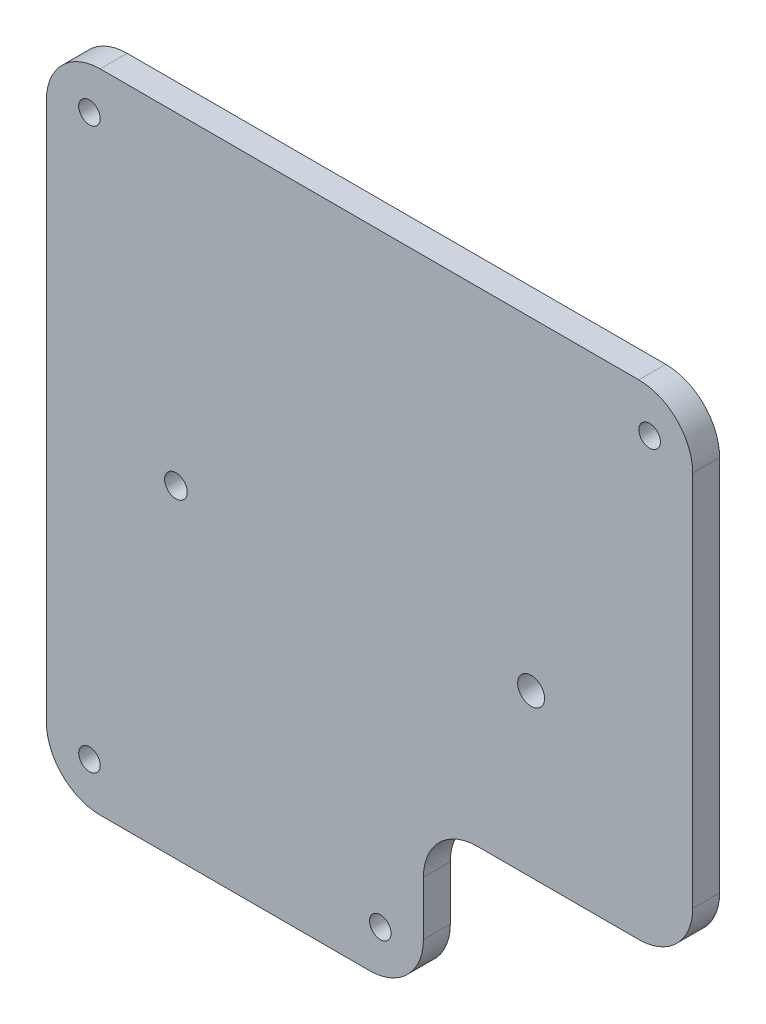
ISO-10303-21;
HEADER;
FILE_DESCRIPTION(('STEP AP214'),'2;1');
FILE_NAME('part.step','',(''),(''),'','','');
FILE_SCHEMA(('AUTOMOTIVE_DESIGN { 1 0 10303 214 1 1 1 1 }'));
ENDSEC;
DATA;
#1=APPLICATION_CONTEXT('core data for automotive mechanical design processes');
#2=APPLICATION_PROTOCOL_DEFINITION('international standard','automotive_design',2000,#1);
#3=PRODUCT_CONTEXT('',#1,'mechanical');
#4=PRODUCT('Part','Part','',(#3));
#5=PRODUCT_RELATED_PRODUCT_CATEGORY('part','',(#4));
#6=PRODUCT_DEFINITION_FORMATION('','',#4);
#7=PRODUCT_DEFINITION_CONTEXT('part definition',#1,'design');
#8=PRODUCT_DEFINITION('design','',#6,#7);
#9=PRODUCT_DEFINITION_SHAPE('','',#8);
#10=(LENGTH_UNIT() NAMED_UNIT(*) SI_UNIT(.MILLI.,.METRE.));
#11=(NAMED_UNIT(*) PLANE_ANGLE_UNIT() SI_UNIT($,.RADIAN.));
#12=(NAMED_UNIT(*) SI_UNIT($,.STERADIAN.) SOLID_ANGLE_UNIT());
#13=UNCERTAINTY_MEASURE_WITH_UNIT(LENGTH_MEASURE(1.E-05),#10,'distance_accuracy_value','');
#14=(GEOMETRIC_REPRESENTATION_CONTEXT(3) GLOBAL_UNCERTAINTY_ASSIGNED_CONTEXT((#13)) GLOBAL_UNIT_ASSIGNED_CONTEXT((#10,
#11,#12)) REPRESENTATION_CONTEXT('',''));
#15=CARTESIAN_POINT('',(0.,0.,0.));
#16=DIRECTION('',(0.,0.,1.));
#17=DIRECTION('',(1.,0.,0.));
#18=AXIS2_PLACEMENT_3D('',#15,#16,#17);
#19=CARTESIAN_POINT('',(60.,10.,5.));
#20=DIRECTION('',(0.,0.,-1.));
#21=DIRECTION('',(-1.,0.,0.));
#22=AXIS2_PLACEMENT_3D('',#19,#20,#21);
#23=CYLINDRICAL_SURFACE('',#22,10.);
#24=CARTESIAN_POINT('',(60.,10.,0.));
#25=DIRECTION('',(0.,0.,1.));
#26=DIRECTION('',(-1.,0.,0.));
#27=AXIS2_PLACEMENT_3D('',#24,#25,#26);
#28=CIRCLE('',#27,10.);
#29=CARTESIAN_POINT('',(59.9999999999999,0.,0.));
#30=VERTEX_POINT('',#29);
#31=CARTESIAN_POINT('',(70.,10.0000000000001,0.));
#32=VERTEX_POINT('',#31);
#33=EDGE_CURVE('E157',#30,#32,#28,.T.);
#34=ORIENTED_EDGE('',*,*,#33,.T.);
#35=DIRECTION('',(0.,0.,-1.));
#36=VECTOR('',#35,1.);
#37=CARTESIAN_POINT('',(70.,10.0000000000001,5.));
#38=LINE('',#37,#36);
#39=CARTESIAN_POINT('',(70.,10.0000000000001,5.));
#40=VERTEX_POINT('',#39);
#41=EDGE_CURVE('E11',#40,#32,#38,.T.);
#42=ORIENTED_EDGE('',*,*,#41,.F.);
#43=CARTESIAN_POINT('',(60.,10.,5.));
#44=DIRECTION('',(0.,0.,1.));
#45=DIRECTION('',(-1.,0.,0.));
#46=AXIS2_PLACEMENT_3D('',#43,#44,#45);
#47=CIRCLE('',#46,10.);
#48=CARTESIAN_POINT('',(59.9999999999999,0.,5.));
#49=VERTEX_POINT('',#48);
#50=EDGE_CURVE('E180',#49,#40,#47,.T.);
#51=ORIENTED_EDGE('',*,*,#50,.F.);
#52=DIRECTION('',(0.,0.,-1.));
#53=VECTOR('',#52,1.);
#54=CARTESIAN_POINT('',(59.9999999999999,0.,5.));
#55=LINE('',#54,#53);
#56=EDGE_CURVE('E153',#49,#30,#55,.T.);
#57=ORIENTED_EDGE('',*,*,#56,.T.);
#58=EDGE_LOOP('',(#34,#42,#51,#57));
#59=FACE_BOUND('',#58,.T.);
#60=ADVANCED_FACE('F35',(#59),#23,.T.);
#61=CARTESIAN_POINT('',(70.,19.9999999999999,5.));
#62=DIRECTION('',(-1.,0.,0.));
#63=DIRECTION('',(0.,0.,1.));
#64=AXIS2_PLACEMENT_3D('',#61,#62,#63);
#65=PLANE('',#64);
#66=DIRECTION('',(0.,1.,0.));
#67=VECTOR('',#66,1.);
#68=CARTESIAN_POINT('',(70.,19.9999999999999,0.));
#69=LINE('',#68,#67);
#70=CARTESIAN_POINT('',(70.,19.9999999999999,0.));
#71=VERTEX_POINT('',#70);
#72=EDGE_CURVE('E160',#32,#71,#69,.T.);
#73=ORIENTED_EDGE('',*,*,#72,.T.);
#74=DIRECTION('',(0.,0.,-1.));
#75=VECTOR('',#74,1.);
#76=CARTESIAN_POINT('',(70.,19.9999999999999,5.));
#77=LINE('',#76,#75);
#78=CARTESIAN_POINT('',(70.,19.9999999999999,5.));
#79=VERTEX_POINT('',#78);
#80=EDGE_CURVE('E44',#79,#71,#77,.T.);
#81=ORIENTED_EDGE('',*,*,#80,.F.);
#82=DIRECTION('',(0.,1.,0.));
#83=VECTOR('',#82,1.);
#84=CARTESIAN_POINT('',(70.,19.9999999999999,5.));
#85=LINE('',#84,#83);
#86=EDGE_CURVE('E108',#40,#79,#85,.T.);
#87=ORIENTED_EDGE('',*,*,#86,.F.);
#88=ORIENTED_EDGE('',*,*,#41,.T.);
#89=EDGE_LOOP('',(#73,#81,#87,#88));
#90=FACE_BOUND('',#89,.T.);
#91=ADVANCED_FACE('F273',(#90),#65,.F.);
#92=CARTESIAN_POINT('',(80.,20.,5.));
#93=DIRECTION('',(0.,0.,-1.));
#94=DIRECTION('',(-1.,0.,0.));
#95=AXIS2_PLACEMENT_3D('',#92,#93,#94);
#96=CYLINDRICAL_SURFACE('',#95,10.);
#97=CARTESIAN_POINT('',(80.,20.,0.));
#98=DIRECTION('',(0.,0.,-1.));
#99=DIRECTION('',(1.,0.,0.));
#100=AXIS2_PLACEMENT_3D('',#97,#98,#99);
#101=CIRCLE('',#100,10.);
#102=CARTESIAN_POINT('',(80.0000000000001,30.,0.));
#103=VERTEX_POINT('',#102);
#104=EDGE_CURVE('E163',#71,#103,#101,.T.);
#105=ORIENTED_EDGE('',*,*,#104,.T.);
#106=DIRECTION('',(0.,0.,-1.));
#107=VECTOR('',#106,1.);
#108=CARTESIAN_POINT('',(80.0000000000001,30.,5.));
#109=LINE('',#108,#107);
#110=CARTESIAN_POINT('',(80.0000000000001,30.,5.));
#111=VERTEX_POINT('',#110);
#112=EDGE_CURVE('E199',#111,#103,#109,.T.);
#113=ORIENTED_EDGE('',*,*,#112,.F.);
#114=CARTESIAN_POINT('',(80.,20.,5.));
#115=DIRECTION('',(0.,0.,-1.));
#116=DIRECTION('',(1.,0.,0.));
#117=AXIS2_PLACEMENT_3D('',#114,#115,#116);
#118=CIRCLE('',#117,10.);
#119=EDGE_CURVE('E233',#79,#111,#118,.T.);
#120=ORIENTED_EDGE('',*,*,#119,.F.);
#121=ORIENTED_EDGE('',*,*,#80,.T.);
#122=EDGE_LOOP('',(#105,#113,#120,#121));
#123=FACE_BOUND('',#122,.T.);
#124=ADVANCED_FACE('F277',(#123),#96,.F.);
#125=CARTESIAN_POINT('',(110.,30.,5.));
#126=DIRECTION('',(0.,1.,0.));
#127=DIRECTION('',(-1.,0.,0.));
#128=AXIS2_PLACEMENT_3D('',#125,#126,#127);
#129=PLANE('',#128);
#130=DIRECTION('',(1.,0.,0.));
#131=VECTOR('',#130,1.);
#132=CARTESIAN_POINT('',(110.,30.,0.));
#133=LINE('',#132,#131);
#134=CARTESIAN_POINT('',(110.,30.,0.));
#135=VERTEX_POINT('',#134);
#136=EDGE_CURVE('E165',#103,#135,#133,.T.);
#137=ORIENTED_EDGE('',*,*,#136,.T.);
#138=DIRECTION('',(0.,0.,-1.));
#139=VECTOR('',#138,1.);
#140=CARTESIAN_POINT('',(110.,30.,5.));
#141=LINE('',#140,#139);
#142=CARTESIAN_POINT('',(110.,30.,5.));
#143=VERTEX_POINT('',#142);
#144=EDGE_CURVE('E196',#143,#135,#141,.T.);
#145=ORIENTED_EDGE('',*,*,#144,.F.);
#146=DIRECTION('',(1.,0.,0.));
#147=VECTOR('',#146,1.);
#148=CARTESIAN_POINT('',(110.,30.,5.));
#149=LINE('',#148,#147);
#150=EDGE_CURVE('E235',#111,#143,#149,.T.);
#151=ORIENTED_EDGE('',*,*,#150,.F.);
#152=ORIENTED_EDGE('',*,*,#112,.T.);
#153=EDGE_LOOP('',(#137,#145,#151,#152));
#154=FACE_BOUND('',#153,.T.);
#155=ADVANCED_FACE('F281',(#154),#129,.F.);
#156=CARTESIAN_POINT('',(110.,40.,5.));
#157=DIRECTION('',(0.,0.,-1.));
#158=DIRECTION('',(-1.,0.,0.));
#159=AXIS2_PLACEMENT_3D('',#156,#157,#158);
#160=CYLINDRICAL_SURFACE('',#159,10.);
#161=CARTESIAN_POINT('',(110.,40.,0.));
#162=DIRECTION('',(0.,0.,1.));
#163=DIRECTION('',(1.,0.,0.));
#164=AXIS2_PLACEMENT_3D('',#161,#162,#163);
#165=CIRCLE('',#164,10.);
#166=CARTESIAN_POINT('',(120.,40.,0.));
#167=VERTEX_POINT('',#166);
#168=EDGE_CURVE('E167',#135,#167,#165,.T.);
#169=ORIENTED_EDGE('',*,*,#168,.T.);
#170=DIRECTION('',(0.,0.,-1.));
#171=VECTOR('',#170,1.);
#172=CARTESIAN_POINT('',(120.,40.,5.));
#173=LINE('',#172,#171);
#174=CARTESIAN_POINT('',(120.,40.,5.));
#175=VERTEX_POINT('',#174);
#176=EDGE_CURVE('E193',#175,#167,#173,.T.);
#177=ORIENTED_EDGE('',*,*,#176,.F.);
#178=CARTESIAN_POINT('',(110.,40.,5.));
#179=DIRECTION('',(0.,0.,1.));
#180=DIRECTION('',(1.,0.,0.));
#181=AXIS2_PLACEMENT_3D('',#178,#179,#180);
#182=CIRCLE('',#181,10.);
#183=EDGE_CURVE('E237',#143,#175,#182,.T.);
#184=ORIENTED_EDGE('',*,*,#183,.F.);
#185=ORIENTED_EDGE('',*,*,#144,.T.);
#186=EDGE_LOOP('',(#169,#177,#184,#185));
#187=FACE_BOUND('',#186,.T.);
#188=ADVANCED_FACE('F287',(#187),#160,.T.);
#189=CARTESIAN_POINT('',(120.,40.0000000000001,5.));
#190=DIRECTION('',(-1.,0.,0.));
#191=DIRECTION('',(0.,0.,1.));
#192=AXIS2_PLACEMENT_3D('',#189,#190,#191);
#193=PLANE('',#192);
#194=DIRECTION('',(0.,1.,0.));
#195=VECTOR('',#194,1.);
#196=CARTESIAN_POINT('',(120.,40.0000000000001,0.));
#197=LINE('',#196,#195);
#198=CARTESIAN_POINT('',(120.,110.,0.));
#199=VERTEX_POINT('',#198);
#200=EDGE_CURVE('E169',#167,#199,#197,.T.);
#201=ORIENTED_EDGE('',*,*,#200,.T.);
#202=DIRECTION('',(0.,0.,-1.));
#203=VECTOR('',#202,1.);
#204=CARTESIAN_POINT('',(120.,110.,5.));
#205=LINE('',#204,#203);
#206=CARTESIAN_POINT('',(120.,110.,5.));
#207=VERTEX_POINT('',#206);
#208=EDGE_CURVE('E190',#207,#199,#205,.T.);
#209=ORIENTED_EDGE('',*,*,#208,.F.);
#210=DIRECTION('',(0.,1.,0.));
#211=VECTOR('',#210,1.);
#212=CARTESIAN_POINT('',(120.,40.0000000000001,5.));
#213=LINE('',#212,#211);
#214=EDGE_CURVE('E239',#175,#207,#213,.T.);
#215=ORIENTED_EDGE('',*,*,#214,.F.);
#216=ORIENTED_EDGE('',*,*,#176,.T.);
#217=EDGE_LOOP('',(#201,#209,#215,#216));
#218=FACE_BOUND('',#217,.T.);
#219=ADVANCED_FACE('F291',(#218),#193,.F.);
#220=CARTESIAN_POINT('',(110.,110.,5.));
#221=DIRECTION('',(0.,0.,-1.));
#222=DIRECTION('',(-1.,0.,0.));
#223=AXIS2_PLACEMENT_3D('',#220,#221,#222);
#224=CYLINDRICAL_SURFACE('',#223,9.99999999999999);
#225=CARTESIAN_POINT('',(110.,110.,0.));
#226=DIRECTION('',(0.,0.,1.));
#227=DIRECTION('',(-1.,0.,0.));
#228=AXIS2_PLACEMENT_3D('',#225,#226,#227);
#229=CIRCLE('',#228,9.99999999999999);
#230=CARTESIAN_POINT('',(110.,120.,0.));
#231=VERTEX_POINT('',#230);
#232=EDGE_CURVE('E171',#199,#231,#229,.T.);
#233=ORIENTED_EDGE('',*,*,#232,.T.);
#234=DIRECTION('',(0.,0.,-1.));
#235=VECTOR('',#234,1.);
#236=CARTESIAN_POINT('',(110.,120.,5.));
#237=LINE('',#236,#235);
#238=CARTESIAN_POINT('',(110.,120.,5.));
#239=VERTEX_POINT('',#238);
#240=EDGE_CURVE('E187',#239,#231,#237,.T.);
#241=ORIENTED_EDGE('',*,*,#240,.F.);
#242=CARTESIAN_POINT('',(110.,110.,5.));
#243=DIRECTION('',(0.,0.,1.));
#244=DIRECTION('',(-1.,0.,0.));
#245=AXIS2_PLACEMENT_3D('',#242,#243,#244);
#246=CIRCLE('',#245,9.99999999999999);
#247=EDGE_CURVE('E241',#207,#239,#246,.T.);
#248=ORIENTED_EDGE('',*,*,#247,.F.);
#249=ORIENTED_EDGE('',*,*,#208,.T.);
#250=EDGE_LOOP('',(#233,#241,#248,#249));
#251=FACE_BOUND('',#250,.T.);
#252=ADVANCED_FACE('F295',(#251),#224,.T.);
#253=CARTESIAN_POINT('',(10.0000000000001,120.,5.));
#254=DIRECTION('',(0.,-1.,0.));
#255=DIRECTION('',(0.,0.,-1.));
#256=AXIS2_PLACEMENT_3D('',#253,#254,#255);
#257=PLANE('',#256);
#258=DIRECTION('',(-1.,0.,0.));
#259=VECTOR('',#258,1.);
#260=CARTESIAN_POINT('',(10.0000000000001,120.,0.));
#261=LINE('',#260,#259);
#262=CARTESIAN_POINT('',(10.0000000000001,120.,0.));
#263=VERTEX_POINT('',#262);
#264=EDGE_CURVE('E173',#231,#263,#261,.T.);
#265=ORIENTED_EDGE('',*,*,#264,.T.);
#266=DIRECTION('',(0.,0.,-1.));
#267=VECTOR('',#266,1.);
#268=CARTESIAN_POINT('',(10.0000000000001,120.,5.));
#269=LINE('',#268,#267);
#270=CARTESIAN_POINT('',(10.0000000000001,120.,5.));
#271=VERTEX_POINT('',#270);
#272=EDGE_CURVE('E184',#271,#263,#269,.T.);
#273=ORIENTED_EDGE('',*,*,#272,.F.);
#274=DIRECTION('',(-1.,0.,0.));
#275=VECTOR('',#274,1.);
#276=CARTESIAN_POINT('',(10.0000000000001,120.,5.));
#277=LINE('',#276,#275);
#278=EDGE_CURVE('E243',#239,#271,#277,.T.);
#279=ORIENTED_EDGE('',*,*,#278,.F.);
#280=ORIENTED_EDGE('',*,*,#240,.T.);
#281=EDGE_LOOP('',(#265,#273,#279,#280));
#282=FACE_BOUND('',#281,.T.);
#283=ADVANCED_FACE('F249',(#282),#257,.F.);
#284=CARTESIAN_POINT('',(10.,110.,5.));
#285=DIRECTION('',(0.,0.,-1.));
#286=DIRECTION('',(-1.,0.,0.));
#287=AXIS2_PLACEMENT_3D('',#284,#285,#286);
#288=CYLINDRICAL_SURFACE('',#287,10.);
#289=CARTESIAN_POINT('',(10.,110.,0.));
#290=DIRECTION('',(0.,0.,1.));
#291=DIRECTION('',(-1.,0.,0.));
#292=AXIS2_PLACEMENT_3D('',#289,#290,#291);
#293=CIRCLE('',#292,10.);
#294=CARTESIAN_POINT('',(0.,110.,0.));
#295=VERTEX_POINT('',#294);
#296=EDGE_CURVE('E175',#263,#295,#293,.T.);
#297=ORIENTED_EDGE('',*,*,#296,.T.);
#298=DIRECTION('',(0.,0.,-1.));
#299=VECTOR('',#298,1.);
#300=CARTESIAN_POINT('',(0.,110.,5.));
#301=LINE('',#300,#299);
#302=CARTESIAN_POINT('',(0.,110.,5.));
#303=VERTEX_POINT('',#302);
#304=EDGE_CURVE('E148',#303,#295,#301,.T.);
#305=ORIENTED_EDGE('',*,*,#304,.F.);
#306=CARTESIAN_POINT('',(10.,110.,5.));
#307=DIRECTION('',(0.,0.,1.));
#308=DIRECTION('',(-1.,0.,0.));
#309=AXIS2_PLACEMENT_3D('',#306,#307,#308);
#310=CIRCLE('',#309,10.);
#311=EDGE_CURVE('E139',#271,#303,#310,.T.);
#312=ORIENTED_EDGE('',*,*,#311,.F.);
#313=ORIENTED_EDGE('',*,*,#272,.T.);
#314=EDGE_LOOP('',(#297,#305,#312,#313));
#315=FACE_BOUND('',#314,.T.);
#316=ADVANCED_FACE('F253',(#315),#288,.T.);
#317=CARTESIAN_POINT('',(0.,10.0000000000001,5.));
#318=DIRECTION('',(1.,0.,0.));
#319=DIRECTION('',(0.,0.,-1.));
#320=AXIS2_PLACEMENT_3D('',#317,#318,#319);
#321=PLANE('',#320);
#322=DIRECTION('',(0.,-1.,0.));
#323=VECTOR('',#322,1.);
#324=CARTESIAN_POINT('',(0.,10.0000000000001,0.));
#325=LINE('',#324,#323);
#326=CARTESIAN_POINT('',(0.,10.0000000000001,0.));
#327=VERTEX_POINT('',#326);
#328=EDGE_CURVE('E147',#295,#327,#325,.T.);
#329=ORIENTED_EDGE('',*,*,#328,.T.);
#330=DIRECTION('',(0.,0.,-1.));
#331=VECTOR('',#330,1.);
#332=CARTESIAN_POINT('',(0.,10.0000000000001,5.));
#333=LINE('',#332,#331);
#334=CARTESIAN_POINT('',(0.,10.0000000000001,5.));
#335=VERTEX_POINT('',#334);
#336=EDGE_CURVE('E144',#335,#327,#333,.T.);
#337=ORIENTED_EDGE('',*,*,#336,.F.);
#338=DIRECTION('',(0.,-1.,0.));
#339=VECTOR('',#338,1.);
#340=CARTESIAN_POINT('',(0.,10.0000000000001,5.));
#341=LINE('',#340,#339);
#342=EDGE_CURVE('E133',#303,#335,#341,.T.);
#343=ORIENTED_EDGE('',*,*,#342,.F.);
#344=ORIENTED_EDGE('',*,*,#304,.T.);
#345=EDGE_LOOP('',(#329,#337,#343,#344));
#346=FACE_BOUND('',#345,.T.);
#347=ADVANCED_FACE('F145',(#346),#321,.F.);
#348=CARTESIAN_POINT('',(10.,10.,5.));
#349=DIRECTION('',(0.,0.,-1.));
#350=DIRECTION('',(-1.,0.,0.));
#351=AXIS2_PLACEMENT_3D('',#348,#349,#350);
#352=CYLINDRICAL_SURFACE('',#351,10.);
#353=CARTESIAN_POINT('',(10.,10.,0.));
#354=DIRECTION('',(0.,0.,1.));
#355=DIRECTION('',(-1.,0.,0.));
#356=AXIS2_PLACEMENT_3D('',#353,#354,#355);
#357=CIRCLE('',#356,10.);
#358=CARTESIAN_POINT('',(10.0000000000001,0.,0.));
#359=VERTEX_POINT('',#358);
#360=EDGE_CURVE('E94',#327,#359,#357,.T.);
#361=ORIENTED_EDGE('',*,*,#360,.T.);
#362=DIRECTION('',(0.,0.,-1.));
#363=VECTOR('',#362,1.);
#364=CARTESIAN_POINT('',(10.0000000000001,0.,5.));
#365=LINE('',#364,#363);
#366=CARTESIAN_POINT('',(10.0000000000001,0.,5.));
#367=VERTEX_POINT('',#366);
#368=EDGE_CURVE('E149',#367,#359,#365,.T.);
#369=ORIENTED_EDGE('',*,*,#368,.F.);
#370=CARTESIAN_POINT('',(10.,10.,5.));
#371=DIRECTION('',(0.,0.,1.));
#372=DIRECTION('',(-1.,0.,0.));
#373=AXIS2_PLACEMENT_3D('',#370,#371,#372);
#374=CIRCLE('',#373,10.);
#375=EDGE_CURVE('E137',#335,#367,#374,.T.);
#376=ORIENTED_EDGE('',*,*,#375,.F.);
#377=ORIENTED_EDGE('',*,*,#336,.T.);
#378=EDGE_LOOP('',(#361,#369,#376,#377));
#379=FACE_BOUND('',#378,.T.);
#380=ADVANCED_FACE('F151',(#379),#352,.T.);
#381=CARTESIAN_POINT('',(10.0000000000001,0.,5.));
#382=DIRECTION('',(0.,1.,0.));
#383=DIRECTION('',(-1.,0.,0.));
#384=AXIS2_PLACEMENT_3D('',#381,#382,#383);
#385=PLANE('',#384);
#386=DIRECTION('',(1.,0.,0.));
#387=VECTOR('',#386,1.);
#388=CARTESIAN_POINT('',(10.0000000000001,0.,0.));
#389=LINE('',#388,#387);
#390=EDGE_CURVE('E100',#359,#30,#389,.T.);
#391=ORIENTED_EDGE('',*,*,#390,.T.);
#392=ORIENTED_EDGE('',*,*,#56,.F.);
#393=DIRECTION('',(1.,0.,0.));
#394=VECTOR('',#393,1.);
#395=CARTESIAN_POINT('',(10.0000000000001,0.,5.));
#396=LINE('',#395,#394);
#397=EDGE_CURVE('E53',#367,#49,#396,.T.);
#398=ORIENTED_EDGE('',*,*,#397,.F.);
#399=ORIENTED_EDGE('',*,*,#368,.T.);
#400=EDGE_LOOP('',(#391,#392,#398,#399));
#401=FACE_BOUND('',#400,.T.);
#402=ADVANCED_FACE('F261',(#401),#385,.F.);
#403=CARTESIAN_POINT('',(60.,10.,5.));
#404=DIRECTION('',(0.,0.,-1.));
#405=DIRECTION('',(-1.,0.,0.));
#406=AXIS2_PLACEMENT_3D('',#403,#404,#405);
#407=PLANE('',#406);
#408=CARTESIAN_POINT('',(24.06,60.,5.));
#409=DIRECTION('',(0.,0.,1.));
#410=DIRECTION('',(1.,0.,0.));
#411=AXIS2_PLACEMENT_3D('',#408,#409,#410);
#412=CIRCLE('',#411,2.1);
#413=CARTESIAN_POINT('',(26.16,60.,5.));
#414=VERTEX_POINT('',#413);
#415=EDGE_CURVE('E396',#414,#414,#412,.T.);
#416=ORIENTED_EDGE('',*,*,#415,.F.);
#417=EDGE_LOOP('',(#416));
#418=FACE_BOUND('',#417,.T.);
#419=CARTESIAN_POINT('',(62.,8.00000000000002,5.));
#420=DIRECTION('',(0.,0.,1.));
#421=DIRECTION('',(1.,0.,0.));
#422=AXIS2_PLACEMENT_3D('',#419,#420,#421);
#423=CIRCLE('',#422,1.99999999999999);
#424=CARTESIAN_POINT('',(64.,8.00000000000002,5.));
#425=VERTEX_POINT('',#424);
#426=EDGE_CURVE('E397',#425,#425,#423,.T.);
#427=ORIENTED_EDGE('',*,*,#426,.F.);
#428=EDGE_LOOP('',(#427));
#429=FACE_BOUND('',#428,.T.);
#430=CARTESIAN_POINT('',(90.,60.,5.));
#431=DIRECTION('',(0.,0.,1.));
#432=DIRECTION('',(1.,0.,0.));
#433=AXIS2_PLACEMENT_3D('',#430,#431,#432);
#434=CIRCLE('',#433,2.5);
#435=CARTESIAN_POINT('',(92.5,60.,5.));
#436=VERTEX_POINT('',#435);
#437=EDGE_CURVE('E400',#436,#436,#434,.T.);
#438=ORIENTED_EDGE('',*,*,#437,.F.);
#439=EDGE_LOOP('',(#438));
#440=FACE_BOUND('',#439,.T.);
#441=CARTESIAN_POINT('',(112.,112.,5.));
#442=DIRECTION('',(0.,0.,1.));
#443=DIRECTION('',(-1.,0.,0.));
#444=AXIS2_PLACEMENT_3D('',#441,#442,#443);
#445=CIRCLE('',#444,2.00000000000001);
#446=CARTESIAN_POINT('',(110.,112.,5.));
#447=VERTEX_POINT('',#446);
#448=EDGE_CURVE('E229',#447,#447,#445,.T.);
#449=ORIENTED_EDGE('',*,*,#448,.F.);
#450=EDGE_LOOP('',(#449));
#451=FACE_BOUND('',#450,.T.);
#452=CARTESIAN_POINT('',(8.,8.00000000000002,5.));
#453=DIRECTION('',(0.,0.,1.));
#454=DIRECTION('',(-1.,0.,0.));
#455=AXIS2_PLACEMENT_3D('',#452,#453,#454);
#456=CIRCLE('',#455,2.);
#457=CARTESIAN_POINT('',(6.,8.00000000000002,5.));
#458=VERTEX_POINT('',#457);
#459=EDGE_CURVE('E211',#458,#458,#456,.T.);
#460=ORIENTED_EDGE('',*,*,#459,.F.);
#461=EDGE_LOOP('',(#460));
#462=FACE_BOUND('',#461,.T.);
#463=CARTESIAN_POINT('',(8.,112.,5.));
#464=DIRECTION('',(0.,0.,1.));
#465=DIRECTION('',(1.,0.,0.));
#466=AXIS2_PLACEMENT_3D('',#463,#464,#465);
#467=CIRCLE('',#466,2.);
#468=CARTESIAN_POINT('',(10.,112.,5.));
#469=VERTEX_POINT('',#468);
#470=EDGE_CURVE('E206',#469,#469,#467,.T.);
#471=ORIENTED_EDGE('',*,*,#470,.F.);
#472=EDGE_LOOP('',(#471));
#473=FACE_BOUND('',#472,.T.);
#474=ORIENTED_EDGE('',*,*,#50,.T.);
#475=ORIENTED_EDGE('',*,*,#86,.T.);
#476=ORIENTED_EDGE('',*,*,#119,.T.);
#477=ORIENTED_EDGE('',*,*,#150,.T.);
#478=ORIENTED_EDGE('',*,*,#183,.T.);
#479=ORIENTED_EDGE('',*,*,#214,.T.);
#480=ORIENTED_EDGE('',*,*,#247,.T.);
#481=ORIENTED_EDGE('',*,*,#278,.T.);
#482=ORIENTED_EDGE('',*,*,#311,.T.);
#483=ORIENTED_EDGE('',*,*,#342,.T.);
#484=ORIENTED_EDGE('',*,*,#375,.T.);
#485=ORIENTED_EDGE('',*,*,#397,.T.);
#486=EDGE_LOOP('',(#474,#475,#476,#477,#478,#479,#480,#481,#482,#483,#484,#485));
#487=FACE_BOUND('',#486,.T.);
#488=ADVANCED_FACE('F135',(#418,#429,#440,#451,#462,#473,#487),#407,.F.);
#489=CARTESIAN_POINT('',(60.,10.,0.));
#490=DIRECTION('',(0.,0.,-1.));
#491=DIRECTION('',(-1.,0.,0.));
#492=AXIS2_PLACEMENT_3D('',#489,#490,#491);
#493=PLANE('',#492);
#494=CARTESIAN_POINT('',(24.06,60.,0.));
#495=DIRECTION('',(0.,0.,-1.));
#496=DIRECTION('',(-1.,0.,0.));
#497=AXIS2_PLACEMENT_3D('',#494,#495,#496);
#498=CIRCLE('',#497,2.1);
#499=CARTESIAN_POINT('',(21.96,60.,0.));
#500=VERTEX_POINT('',#499);
#501=EDGE_CURVE('E38',#500,#500,#498,.T.);
#502=ORIENTED_EDGE('',*,*,#501,.F.);
#503=EDGE_LOOP('',(#502));
#504=FACE_BOUND('',#503,.T.);
#505=CARTESIAN_POINT('',(62.,8.00000000000002,0.));
#506=DIRECTION('',(0.,0.,-1.));
#507=DIRECTION('',(-1.,0.,0.));
#508=AXIS2_PLACEMENT_3D('',#505,#506,#507);
#509=CIRCLE('',#508,1.99999999999999);
#510=CARTESIAN_POINT('',(60.,8.00000000000002,0.));
#511=VERTEX_POINT('',#510);
#512=EDGE_CURVE('E216',#511,#511,#509,.T.);
#513=ORIENTED_EDGE('',*,*,#512,.F.);
#514=EDGE_LOOP('',(#513));
#515=FACE_BOUND('',#514,.T.);
#516=CARTESIAN_POINT('',(90.,60.,0.));
#517=DIRECTION('',(0.,0.,-1.));
#518=DIRECTION('',(-1.,0.,0.));
#519=AXIS2_PLACEMENT_3D('',#516,#517,#518);
#520=CIRCLE('',#519,2.5);
#521=CARTESIAN_POINT('',(87.5,60.,0.));
#522=VERTEX_POINT('',#521);
#523=EDGE_CURVE('E214',#522,#522,#520,.T.);
#524=ORIENTED_EDGE('',*,*,#523,.F.);
#525=EDGE_LOOP('',(#524));
#526=FACE_BOUND('',#525,.T.);
#527=CARTESIAN_POINT('',(112.,112.,0.));
#528=DIRECTION('',(0.,0.,-1.));
#529=DIRECTION('',(-1.,0.,0.));
#530=AXIS2_PLACEMENT_3D('',#527,#528,#529);
#531=CIRCLE('',#530,2.00000000000001);
#532=CARTESIAN_POINT('',(110.,112.,0.));
#533=VERTEX_POINT('',#532);
#534=EDGE_CURVE('E210',#533,#533,#531,.T.);
#535=ORIENTED_EDGE('',*,*,#534,.F.);
#536=EDGE_LOOP('',(#535));
#537=FACE_BOUND('',#536,.T.);
#538=CARTESIAN_POINT('',(8.,8.00000000000002,0.));
#539=DIRECTION('',(0.,0.,-1.));
#540=DIRECTION('',(-1.,0.,0.));
#541=AXIS2_PLACEMENT_3D('',#538,#539,#540);
#542=CIRCLE('',#541,2.);
#543=CARTESIAN_POINT('',(6.,8.00000000000002,0.));
#544=VERTEX_POINT('',#543);
#545=EDGE_CURVE('E207',#544,#544,#542,.T.);
#546=ORIENTED_EDGE('',*,*,#545,.F.);
#547=EDGE_LOOP('',(#546));
#548=FACE_BOUND('',#547,.T.);
#549=CARTESIAN_POINT('',(8.,112.,0.));
#550=DIRECTION('',(0.,0.,-1.));
#551=DIRECTION('',(-1.,0.,0.));
#552=AXIS2_PLACEMENT_3D('',#549,#550,#551);
#553=CIRCLE('',#552,2.);
#554=CARTESIAN_POINT('',(6.,112.,0.));
#555=VERTEX_POINT('',#554);
#556=EDGE_CURVE('E161',#555,#555,#553,.T.);
#557=ORIENTED_EDGE('',*,*,#556,.F.);
#558=EDGE_LOOP('',(#557));
#559=FACE_BOUND('',#558,.T.);
#560=ORIENTED_EDGE('',*,*,#33,.F.);
#561=ORIENTED_EDGE('',*,*,#390,.F.);
#562=ORIENTED_EDGE('',*,*,#360,.F.);
#563=ORIENTED_EDGE('',*,*,#328,.F.);
#564=ORIENTED_EDGE('',*,*,#296,.F.);
#565=ORIENTED_EDGE('',*,*,#264,.F.);
#566=ORIENTED_EDGE('',*,*,#232,.F.);
#567=ORIENTED_EDGE('',*,*,#200,.F.);
#568=ORIENTED_EDGE('',*,*,#168,.F.);
#569=ORIENTED_EDGE('',*,*,#136,.F.);
#570=ORIENTED_EDGE('',*,*,#104,.F.);
#571=ORIENTED_EDGE('',*,*,#72,.F.);
#572=EDGE_LOOP('',(#560,#561,#562,#563,#564,#565,#566,#567,#568,#569,#570,#571));
#573=FACE_BOUND('',#572,.T.);
#574=ADVANCED_FACE('F256',(#504,#515,#526,#537,#548,#559,#573),#493,.T.);
#575=CARTESIAN_POINT('',(8.,112.,-5.));
#576=DIRECTION('',(0.,0.,1.));
#577=DIRECTION('',(1.,0.,0.));
#578=AXIS2_PLACEMENT_3D('',#575,#576,#577);
#579=CYLINDRICAL_SURFACE('',#578,2.);
#580=ORIENTED_EDGE('',*,*,#556,.T.);
#581=EDGE_LOOP('',(#580));
#582=FACE_BOUND('',#581,.T.);
#583=ORIENTED_EDGE('',*,*,#470,.T.);
#584=EDGE_LOOP('',(#583));
#585=FACE_BOUND('',#584,.T.);
#586=ADVANCED_FACE('F332',(#582,#585),#579,.F.);
#587=CARTESIAN_POINT('',(8.,8.00000000000002,-5.));
#588=DIRECTION('',(0.,0.,1.));
#589=DIRECTION('',(1.,0.,0.));
#590=AXIS2_PLACEMENT_3D('',#587,#588,#589);
#591=CYLINDRICAL_SURFACE('',#590,2.);
#592=ORIENTED_EDGE('',*,*,#545,.T.);
#593=EDGE_LOOP('',(#592));
#594=FACE_BOUND('',#593,.T.);
#595=ORIENTED_EDGE('',*,*,#459,.T.);
#596=EDGE_LOOP('',(#595));
#597=FACE_BOUND('',#596,.T.);
#598=ADVANCED_FACE('F341',(#594,#597),#591,.F.);
#599=CARTESIAN_POINT('',(112.,112.,-5.));
#600=DIRECTION('',(0.,0.,1.));
#601=DIRECTION('',(1.,0.,0.));
#602=AXIS2_PLACEMENT_3D('',#599,#600,#601);
#603=CYLINDRICAL_SURFACE('',#602,2.00000000000001);
#604=ORIENTED_EDGE('',*,*,#534,.T.);
#605=EDGE_LOOP('',(#604));
#606=FACE_BOUND('',#605,.T.);
#607=ORIENTED_EDGE('',*,*,#448,.T.);
#608=EDGE_LOOP('',(#607));
#609=FACE_BOUND('',#608,.T.);
#610=ADVANCED_FACE('F351',(#606,#609),#603,.F.);
#611=CARTESIAN_POINT('',(90.,60.,-5.));
#612=DIRECTION('',(0.,0.,1.));
#613=DIRECTION('',(1.,0.,0.));
#614=AXIS2_PLACEMENT_3D('',#611,#612,#613);
#615=CYLINDRICAL_SURFACE('',#614,2.5);
#616=ORIENTED_EDGE('',*,*,#523,.T.);
#617=EDGE_LOOP('',(#616));
#618=FACE_BOUND('',#617,.T.);
#619=ORIENTED_EDGE('',*,*,#437,.T.);
#620=EDGE_LOOP('',(#619));
#621=FACE_BOUND('',#620,.T.);
#622=ADVANCED_FACE('F361',(#618,#621),#615,.F.);
#623=CARTESIAN_POINT('',(62.,8.00000000000002,-5.));
#624=DIRECTION('',(0.,0.,1.));
#625=DIRECTION('',(1.,0.,0.));
#626=AXIS2_PLACEMENT_3D('',#623,#624,#625);
#627=CYLINDRICAL_SURFACE('',#626,1.99999999999999);
#628=ORIENTED_EDGE('',*,*,#512,.T.);
#629=EDGE_LOOP('',(#628));
#630=FACE_BOUND('',#629,.T.);
#631=ORIENTED_EDGE('',*,*,#426,.T.);
#632=EDGE_LOOP('',(#631));
#633=FACE_BOUND('',#632,.T.);
#634=ADVANCED_FACE('F371',(#630,#633),#627,.F.);
#635=CARTESIAN_POINT('',(24.06,60.,-5.));
#636=DIRECTION('',(0.,0.,1.));
#637=DIRECTION('',(1.,0.,0.));
#638=AXIS2_PLACEMENT_3D('',#635,#636,#637);
#639=CYLINDRICAL_SURFACE('',#638,2.1);
#640=ORIENTED_EDGE('',*,*,#501,.T.);
#641=EDGE_LOOP('',(#640));
#642=FACE_BOUND('',#641,.T.);
#643=ORIENTED_EDGE('',*,*,#415,.T.);
#644=EDGE_LOOP('',(#643));
#645=FACE_BOUND('',#644,.T.);
#646=ADVANCED_FACE('F381',(#642,#645),#639,.F.);
#647=CLOSED_SHELL('',(#60,#91,#124,#155,#188,#219,#252,#283,#316,#347,#380,#402,#488,#574,#586,
#598,#610,#622,#634,#646));
#648=MANIFOLD_SOLID_BREP('B2',#647);
#649=ADVANCED_BREP_SHAPE_REPRESENTATION('',(#18,#648),#14);
#650=SHAPE_DEFINITION_REPRESENTATION(#9,#649);
ENDSEC;
END-ISO-10303-21;
